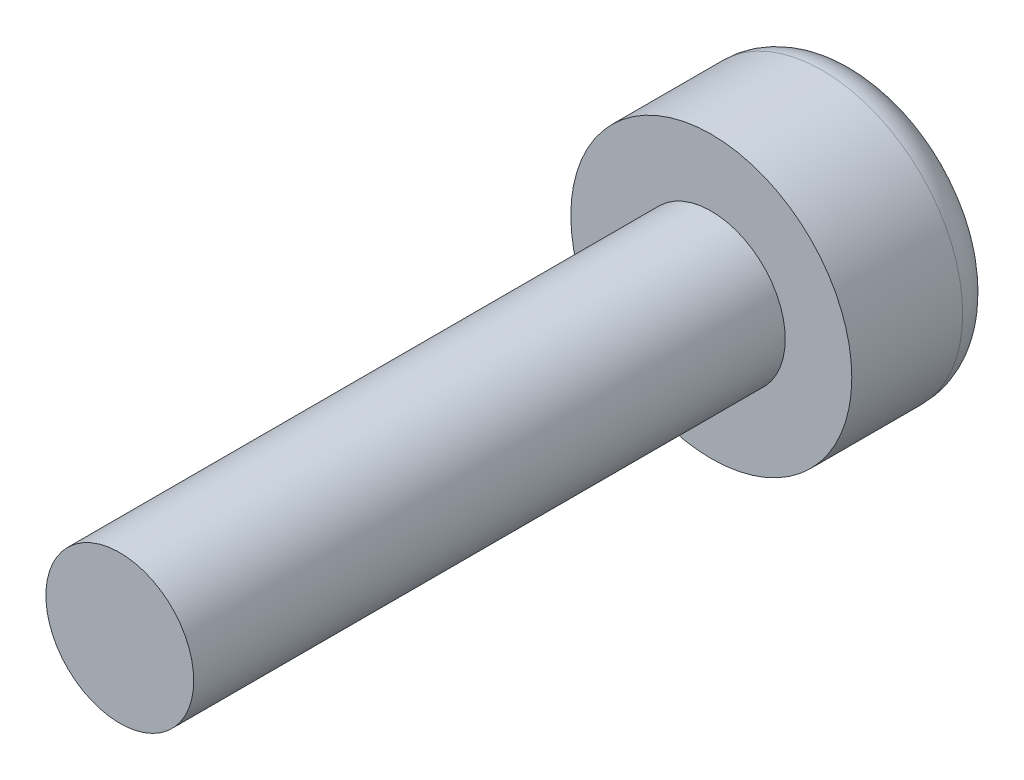
ISO-10303-21;
HEADER;
FILE_DESCRIPTION(('STEP AP214'),'2;1');
FILE_NAME('part.step','',(''),(''),'','','');
FILE_SCHEMA(('AUTOMOTIVE_DESIGN { 1 0 10303 214 1 1 1 1 }'));
ENDSEC;
DATA;
#1=APPLICATION_CONTEXT('core data for automotive mechanical design processes');
#2=APPLICATION_PROTOCOL_DEFINITION('international standard','automotive_design',2000,#1);
#3=PRODUCT_CONTEXT('',#1,'mechanical');
#4=PRODUCT('Part','Part','',(#3));
#5=PRODUCT_RELATED_PRODUCT_CATEGORY('part','',(#4));
#6=PRODUCT_DEFINITION_FORMATION('','',#4);
#7=PRODUCT_DEFINITION_CONTEXT('part definition',#1,'design');
#8=PRODUCT_DEFINITION('design','',#6,#7);
#9=PRODUCT_DEFINITION_SHAPE('','',#8);
#10=(LENGTH_UNIT() NAMED_UNIT(*) SI_UNIT(.MILLI.,.METRE.));
#11=(NAMED_UNIT(*) PLANE_ANGLE_UNIT() SI_UNIT($,.RADIAN.));
#12=(NAMED_UNIT(*) SI_UNIT($,.STERADIAN.) SOLID_ANGLE_UNIT());
#13=UNCERTAINTY_MEASURE_WITH_UNIT(LENGTH_MEASURE(1.E-05),#10,'distance_accuracy_value','');
#14=(GEOMETRIC_REPRESENTATION_CONTEXT(3) GLOBAL_UNCERTAINTY_ASSIGNED_CONTEXT((#13)) GLOBAL_UNIT_ASSIGNED_CONTEXT((#10,
#11,#12)) REPRESENTATION_CONTEXT('',''));
#15=CARTESIAN_POINT('',(0.,0.,0.));
#16=DIRECTION('',(0.,0.,1.));
#17=DIRECTION('',(1.,0.,0.));
#18=AXIS2_PLACEMENT_3D('',#15,#16,#17);
#19=CARTESIAN_POINT('',(0.,0.,2.));
#20=DIRECTION('',(0.,0.,-1.));
#21=DIRECTION('',(-1.,0.,0.));
#22=AXIS2_PLACEMENT_3D('',#19,#20,#21);
#23=CYLINDRICAL_SURFACE('',#22,1.9);
#24=CARTESIAN_POINT('',(0.,0.,0.5));
#25=DIRECTION('',(0.,0.,1.));
#26=DIRECTION('',(1.,0.,0.));
#27=AXIS2_PLACEMENT_3D('',#24,#25,#26);
#28=CIRCLE('',#27,1.9);
#29=CARTESIAN_POINT('',(1.9,0.,0.5));
#30=VERTEX_POINT('',#29);
#31=EDGE_CURVE('E39',#30,#30,#28,.T.);
#32=ORIENTED_EDGE('',*,*,#31,.T.);
#33=EDGE_LOOP('',(#32));
#34=FACE_BOUND('',#33,.T.);
#35=CARTESIAN_POINT('',(0.,0.,2.));
#36=DIRECTION('',(0.,0.,1.));
#37=DIRECTION('',(1.,0.,0.));
#38=AXIS2_PLACEMENT_3D('',#35,#36,#37);
#39=CIRCLE('',#38,1.9);
#40=CARTESIAN_POINT('',(1.9,0.,2.));
#41=VERTEX_POINT('',#40);
#42=EDGE_CURVE('E47',#41,#41,#39,.T.);
#43=ORIENTED_EDGE('',*,*,#42,.F.);
#44=EDGE_LOOP('',(#43));
#45=FACE_BOUND('',#44,.T.);
#46=ADVANCED_FACE('F32',(#34,#45),#23,.T.);
#47=CARTESIAN_POINT('',(0.,0.,2.));
#48=DIRECTION('',(0.,0.,1.));
#49=DIRECTION('',(1.,0.,0.));
#50=AXIS2_PLACEMENT_3D('',#47,#48,#49);
#51=PLANE('',#50);
#52=CARTESIAN_POINT('',(0.,0.,2.));
#53=DIRECTION('',(0.,0.,1.));
#54=DIRECTION('',(1.,0.,0.));
#55=AXIS2_PLACEMENT_3D('',#52,#53,#54);
#56=CIRCLE('',#55,1.);
#57=CARTESIAN_POINT('',(1.,0.,2.));
#58=VERTEX_POINT('',#57);
#59=EDGE_CURVE('E43',#58,#58,#56,.T.);
#60=ORIENTED_EDGE('',*,*,#59,.F.);
#61=EDGE_LOOP('',(#60));
#62=FACE_BOUND('',#61,.T.);
#63=ORIENTED_EDGE('',*,*,#42,.T.);
#64=EDGE_LOOP('',(#63));
#65=FACE_BOUND('',#64,.T.);
#66=ADVANCED_FACE('F65',(#62,#65),#51,.T.);
#67=CARTESIAN_POINT('',(0.,0.,0.));
#68=DIRECTION('',(0.,0.,1.));
#69=DIRECTION('',(1.,0.,0.));
#70=AXIS2_PLACEMENT_3D('',#67,#68,#69);
#71=PLANE('',#70);
#72=CARTESIAN_POINT('',(0.,0.,0.));
#73=DIRECTION('',(0.,0.,1.));
#74=DIRECTION('',(1.,0.,0.));
#75=AXIS2_PLACEMENT_3D('',#72,#73,#74);
#76=CIRCLE('',#75,1.4);
#77=CARTESIAN_POINT('',(1.4,0.,0.));
#78=VERTEX_POINT('',#77);
#79=EDGE_CURVE('E10',#78,#78,#76,.F.);
#80=ORIENTED_EDGE('',*,*,#79,.T.);
#81=EDGE_LOOP('',(#80));
#82=FACE_BOUND('',#81,.T.);
#83=ADVANCED_FACE('F61',(#82),#71,.F.);
#84=CARTESIAN_POINT('',(0.,0.,10.));
#85=DIRECTION('',(0.,0.,-1.));
#86=DIRECTION('',(-1.,0.,0.));
#87=AXIS2_PLACEMENT_3D('',#84,#85,#86);
#88=CYLINDRICAL_SURFACE('',#87,1.);
#89=CARTESIAN_POINT('',(0.,0.,10.));
#90=DIRECTION('',(0.,0.,1.));
#91=DIRECTION('',(1.,0.,0.));
#92=AXIS2_PLACEMENT_3D('',#89,#90,#91);
#93=CIRCLE('',#92,1.);
#94=CARTESIAN_POINT('',(1.,0.,10.));
#95=VERTEX_POINT('',#94);
#96=EDGE_CURVE('E51',#95,#95,#93,.T.);
#97=ORIENTED_EDGE('',*,*,#96,.F.);
#98=EDGE_LOOP('',(#97));
#99=FACE_BOUND('',#98,.T.);
#100=ORIENTED_EDGE('',*,*,#59,.T.);
#101=EDGE_LOOP('',(#100));
#102=FACE_BOUND('',#101,.T.);
#103=ADVANCED_FACE('F58',(#99,#102),#88,.T.);
#104=CARTESIAN_POINT('',(0.,0.,10.));
#105=DIRECTION('',(0.,0.,1.));
#106=DIRECTION('',(1.,0.,0.));
#107=AXIS2_PLACEMENT_3D('',#104,#105,#106);
#108=PLANE('',#107);
#109=ORIENTED_EDGE('',*,*,#96,.T.);
#110=EDGE_LOOP('',(#109));
#111=FACE_BOUND('',#110,.T.);
#112=ADVANCED_FACE('F56',(#111),#108,.T.);
#113=CARTESIAN_POINT('',(0.,0.,0.5));
#114=DIRECTION('',(0.,0.,1.));
#115=DIRECTION('',(1.,0.,0.));
#116=AXIS2_PLACEMENT_3D('',#113,#114,#115);
#117=TOROIDAL_SURFACE('',#116,1.4,0.5);
#118=ORIENTED_EDGE('',*,*,#79,.F.);
#119=EDGE_LOOP('',(#118));
#120=FACE_BOUND('',#119,.T.);
#121=ORIENTED_EDGE('',*,*,#31,.F.);
#122=EDGE_LOOP('',(#121));
#123=FACE_BOUND('',#122,.T.);
#124=ADVANCED_FACE('F34',(#120,#123),#117,.T.);
#125=CLOSED_SHELL('',(#46,#66,#83,#103,#112,#124));
#126=MANIFOLD_SOLID_BREP('B2',#125);
#127=ADVANCED_BREP_SHAPE_REPRESENTATION('',(#18,#126),#14);
#128=SHAPE_DEFINITION_REPRESENTATION(#9,#127);
ENDSEC;
END-ISO-10303-21;
